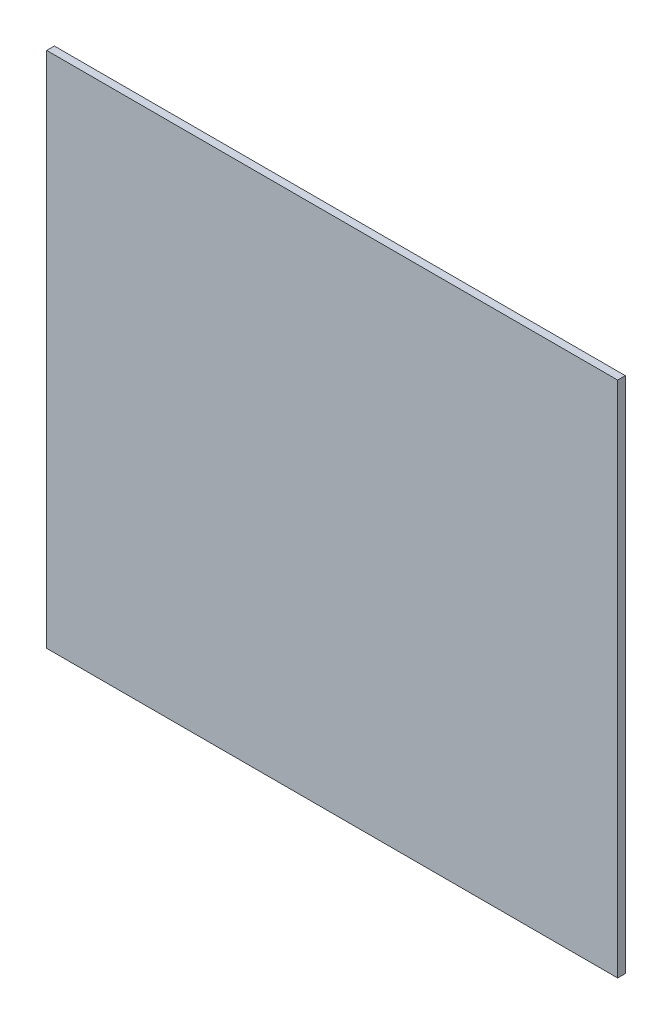
ISO-10303-21;
HEADER;
FILE_DESCRIPTION(('STEP AP214'),'2;1');
FILE_NAME('part.step','',(''),(''),'','','');
FILE_SCHEMA(('AUTOMOTIVE_DESIGN { 1 0 10303 214 1 1 1 1 }'));
ENDSEC;
DATA;
#1=APPLICATION_CONTEXT('core data for automotive mechanical design processes');
#2=APPLICATION_PROTOCOL_DEFINITION('international standard','automotive_design',2000,#1);
#3=PRODUCT_CONTEXT('',#1,'mechanical');
#4=PRODUCT('Part','Part','',(#3));
#5=PRODUCT_RELATED_PRODUCT_CATEGORY('part','',(#4));
#6=PRODUCT_DEFINITION_FORMATION('','',#4);
#7=PRODUCT_DEFINITION_CONTEXT('part definition',#1,'design');
#8=PRODUCT_DEFINITION('design','',#6,#7);
#9=PRODUCT_DEFINITION_SHAPE('','',#8);
#10=(LENGTH_UNIT() NAMED_UNIT(*) SI_UNIT(.MILLI.,.METRE.));
#11=(NAMED_UNIT(*) PLANE_ANGLE_UNIT() SI_UNIT($,.RADIAN.));
#12=(NAMED_UNIT(*) SI_UNIT($,.STERADIAN.) SOLID_ANGLE_UNIT());
#13=UNCERTAINTY_MEASURE_WITH_UNIT(LENGTH_MEASURE(1.E-05),#10,'distance_accuracy_value','');
#14=(GEOMETRIC_REPRESENTATION_CONTEXT(3) GLOBAL_UNCERTAINTY_ASSIGNED_CONTEXT((#13)) GLOBAL_UNIT_ASSIGNED_CONTEXT((#10,
#11,#12)) REPRESENTATION_CONTEXT('',''));
#15=CARTESIAN_POINT('',(0.,0.,0.));
#16=DIRECTION('',(0.,0.,1.));
#17=DIRECTION('',(1.,0.,0.));
#18=AXIS2_PLACEMENT_3D('',#15,#16,#17);
#19=CARTESIAN_POINT('',(161.925,-146.8628,4.3434));
#20=DIRECTION('',(-1.,0.,0.));
#21=DIRECTION('',(0.,0.,1.));
#22=AXIS2_PLACEMENT_3D('',#19,#20,#21);
#23=PLANE('',#22);
#24=DIRECTION('',(0.,1.,0.));
#25=VECTOR('',#24,1.);
#26=CARTESIAN_POINT('',(161.925,-146.8628,0.));
#27=LINE('',#26,#25);
#28=CARTESIAN_POINT('',(161.925,-146.8628,0.));
#29=VERTEX_POINT('',#28);
#30=CARTESIAN_POINT('',(161.925,146.8628,0.));
#31=VERTEX_POINT('',#30);
#32=EDGE_CURVE('E109',#29,#31,#27,.T.);
#33=ORIENTED_EDGE('',*,*,#32,.T.);
#34=DIRECTION('',(0.,0.,-1.));
#35=VECTOR('',#34,1.);
#36=CARTESIAN_POINT('',(161.925,146.8628,4.3434));
#37=LINE('',#36,#35);
#38=CARTESIAN_POINT('',(161.925,146.8628,4.3434));
#39=VERTEX_POINT('',#38);
#40=EDGE_CURVE('E11',#39,#31,#37,.T.);
#41=ORIENTED_EDGE('',*,*,#40,.F.);
#42=DIRECTION('',(0.,1.,0.));
#43=VECTOR('',#42,1.);
#44=CARTESIAN_POINT('',(161.925,-146.8628,4.3434));
#45=LINE('',#44,#43);
#46=CARTESIAN_POINT('',(161.925,-146.8628,4.3434));
#47=VERTEX_POINT('',#46);
#48=EDGE_CURVE('E93',#47,#39,#45,.T.);
#49=ORIENTED_EDGE('',*,*,#48,.F.);
#50=DIRECTION('',(0.,0.,-1.));
#51=VECTOR('',#50,1.);
#52=CARTESIAN_POINT('',(161.925,-146.8628,4.3434));
#53=LINE('',#52,#51);
#54=EDGE_CURVE('E105',#47,#29,#53,.T.);
#55=ORIENTED_EDGE('',*,*,#54,.T.);
#56=EDGE_LOOP('',(#33,#41,#49,#55));
#57=FACE_BOUND('',#56,.T.);
#58=ADVANCED_FACE('F39',(#57),#23,.F.);
#59=CARTESIAN_POINT('',(-161.925,146.8628,4.3434));
#60=DIRECTION('',(0.,-1.,0.));
#61=DIRECTION('',(0.,0.,-1.));
#62=AXIS2_PLACEMENT_3D('',#59,#60,#61);
#63=PLANE('',#62);
#64=DIRECTION('',(-1.,0.,0.));
#65=VECTOR('',#64,1.);
#66=CARTESIAN_POINT('',(-161.925,146.8628,0.));
#67=LINE('',#66,#65);
#68=CARTESIAN_POINT('',(-161.925,146.8628,0.));
#69=VERTEX_POINT('',#68);
#70=EDGE_CURVE('E98',#31,#69,#67,.T.);
#71=ORIENTED_EDGE('',*,*,#70,.T.);
#72=DIRECTION('',(0.,0.,-1.));
#73=VECTOR('',#72,1.);
#74=CARTESIAN_POINT('',(-161.925,146.8628,4.3434));
#75=LINE('',#74,#73);
#76=CARTESIAN_POINT('',(-161.925,146.8628,4.3434));
#77=VERTEX_POINT('',#76);
#78=EDGE_CURVE('E48',#77,#69,#75,.T.);
#79=ORIENTED_EDGE('',*,*,#78,.F.);
#80=DIRECTION('',(-1.,0.,0.));
#81=VECTOR('',#80,1.);
#82=CARTESIAN_POINT('',(-161.925,146.8628,4.3434));
#83=LINE('',#82,#81);
#84=EDGE_CURVE('E88',#39,#77,#83,.T.);
#85=ORIENTED_EDGE('',*,*,#84,.F.);
#86=ORIENTED_EDGE('',*,*,#40,.T.);
#87=EDGE_LOOP('',(#71,#79,#85,#86));
#88=FACE_BOUND('',#87,.T.);
#89=ADVANCED_FACE('F97',(#88),#63,.F.);
#90=CARTESIAN_POINT('',(-161.925,-146.8628,4.3434));
#91=DIRECTION('',(1.,0.,0.));
#92=DIRECTION('',(0.,0.,-1.));
#93=AXIS2_PLACEMENT_3D('',#90,#91,#92);
#94=PLANE('',#93);
#95=DIRECTION('',(0.,-1.,0.));
#96=VECTOR('',#95,1.);
#97=CARTESIAN_POINT('',(-161.925,-146.8628,0.));
#98=LINE('',#97,#96);
#99=CARTESIAN_POINT('',(-161.925,-146.8628,0.));
#100=VERTEX_POINT('',#99);
#101=EDGE_CURVE('E74',#69,#100,#98,.T.);
#102=ORIENTED_EDGE('',*,*,#101,.T.);
#103=DIRECTION('',(0.,0.,-1.));
#104=VECTOR('',#103,1.);
#105=CARTESIAN_POINT('',(-161.925,-146.8628,4.3434));
#106=LINE('',#105,#104);
#107=CARTESIAN_POINT('',(-161.925,-146.8628,4.3434));
#108=VERTEX_POINT('',#107);
#109=EDGE_CURVE('E99',#108,#100,#106,.T.);
#110=ORIENTED_EDGE('',*,*,#109,.F.);
#111=DIRECTION('',(0.,-1.,0.));
#112=VECTOR('',#111,1.);
#113=CARTESIAN_POINT('',(-161.925,-146.8628,4.3434));
#114=LINE('',#113,#112);
#115=EDGE_CURVE('E91',#77,#108,#114,.T.);
#116=ORIENTED_EDGE('',*,*,#115,.F.);
#117=ORIENTED_EDGE('',*,*,#78,.T.);
#118=EDGE_LOOP('',(#102,#110,#116,#117));
#119=FACE_BOUND('',#118,.T.);
#120=ADVANCED_FACE('F100',(#119),#94,.F.);
#121=CARTESIAN_POINT('',(-161.925,-146.8628,4.3434));
#122=DIRECTION('',(0.,1.,0.));
#123=DIRECTION('',(0.,0.,1.));
#124=AXIS2_PLACEMENT_3D('',#121,#122,#123);
#125=PLANE('',#124);
#126=DIRECTION('',(1.,0.,0.));
#127=VECTOR('',#126,1.);
#128=CARTESIAN_POINT('',(-161.925,-146.8628,0.));
#129=LINE('',#128,#127);
#130=EDGE_CURVE('E80',#100,#29,#129,.T.);
#131=ORIENTED_EDGE('',*,*,#130,.T.);
#132=ORIENTED_EDGE('',*,*,#54,.F.);
#133=DIRECTION('',(1.,0.,0.));
#134=VECTOR('',#133,1.);
#135=CARTESIAN_POINT('',(-161.925,-146.8628,4.3434));
#136=LINE('',#135,#134);
#137=EDGE_CURVE('E56',#108,#47,#136,.T.);
#138=ORIENTED_EDGE('',*,*,#137,.F.);
#139=ORIENTED_EDGE('',*,*,#109,.T.);
#140=EDGE_LOOP('',(#131,#132,#138,#139));
#141=FACE_BOUND('',#140,.T.);
#142=ADVANCED_FACE('F117',(#141),#125,.F.);
#143=CARTESIAN_POINT('',(0.,0.,4.3434));
#144=DIRECTION('',(0.,0.,-1.));
#145=DIRECTION('',(-1.,0.,0.));
#146=AXIS2_PLACEMENT_3D('',#143,#144,#145);
#147=PLANE('',#146);
#148=ORIENTED_EDGE('',*,*,#48,.T.);
#149=ORIENTED_EDGE('',*,*,#84,.T.);
#150=ORIENTED_EDGE('',*,*,#115,.T.);
#151=ORIENTED_EDGE('',*,*,#137,.T.);
#152=EDGE_LOOP('',(#148,#149,#150,#151));
#153=FACE_BOUND('',#152,.T.);
#154=ADVANCED_FACE('F89',(#153),#147,.F.);
#155=CARTESIAN_POINT('',(0.,0.,0.));
#156=DIRECTION('',(0.,0.,-1.));
#157=DIRECTION('',(-1.,0.,0.));
#158=AXIS2_PLACEMENT_3D('',#155,#156,#157);
#159=PLANE('',#158);
#160=ORIENTED_EDGE('',*,*,#32,.F.);
#161=ORIENTED_EDGE('',*,*,#130,.F.);
#162=ORIENTED_EDGE('',*,*,#101,.F.);
#163=ORIENTED_EDGE('',*,*,#70,.F.);
#164=EDGE_LOOP('',(#160,#161,#162,#163));
#165=FACE_BOUND('',#164,.T.);
#166=ADVANCED_FACE('F120',(#165),#159,.T.);
#167=CLOSED_SHELL('',(#58,#89,#120,#142,#154,#166));
#168=MANIFOLD_SOLID_BREP('B2',#167);
#169=ADVANCED_BREP_SHAPE_REPRESENTATION('',(#18,#168),#14);
#170=SHAPE_DEFINITION_REPRESENTATION(#9,#169);
ENDSEC;
END-ISO-10303-21;
